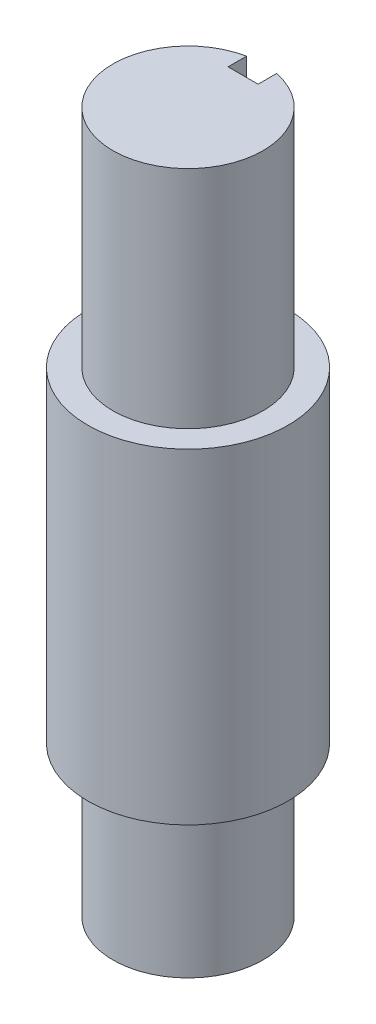
ISO-10303-21;
HEADER;
FILE_DESCRIPTION(('STEP AP214'),'2;1');
FILE_NAME('part.step','',(''),(''),'','','');
FILE_SCHEMA(('AUTOMOTIVE_DESIGN { 1 0 10303 214 1 1 1 1 }'));
ENDSEC;
DATA;
#1=APPLICATION_CONTEXT('core data for automotive mechanical design processes');
#2=APPLICATION_PROTOCOL_DEFINITION('international standard','automotive_design',2000,#1);
#3=PRODUCT_CONTEXT('',#1,'mechanical');
#4=PRODUCT('Part','Part','',(#3));
#5=PRODUCT_RELATED_PRODUCT_CATEGORY('part','',(#4));
#6=PRODUCT_DEFINITION_FORMATION('','',#4);
#7=PRODUCT_DEFINITION_CONTEXT('part definition',#1,'design');
#8=PRODUCT_DEFINITION('design','',#6,#7);
#9=PRODUCT_DEFINITION_SHAPE('','',#8);
#10=(LENGTH_UNIT() NAMED_UNIT(*) SI_UNIT(.MILLI.,.METRE.));
#11=(NAMED_UNIT(*) PLANE_ANGLE_UNIT() SI_UNIT($,.RADIAN.));
#12=(NAMED_UNIT(*) SI_UNIT($,.STERADIAN.) SOLID_ANGLE_UNIT());
#13=UNCERTAINTY_MEASURE_WITH_UNIT(LENGTH_MEASURE(1.E-05),#10,'distance_accuracy_value','');
#14=(GEOMETRIC_REPRESENTATION_CONTEXT(3) GLOBAL_UNCERTAINTY_ASSIGNED_CONTEXT((#13)) GLOBAL_UNIT_ASSIGNED_CONTEXT((#10,
#11,#12)) REPRESENTATION_CONTEXT('',''));
#15=CARTESIAN_POINT('',(0.,0.,0.));
#16=DIRECTION('',(0.,0.,1.));
#17=DIRECTION('',(1.,0.,0.));
#18=AXIS2_PLACEMENT_3D('',#15,#16,#17);
#19=CARTESIAN_POINT('',(0.,40.,0.));
#20=DIRECTION('',(0.,-1.,0.));
#21=DIRECTION('',(0.,0.,-1.));
#22=AXIS2_PLACEMENT_3D('',#19,#20,#21);
#23=CYLINDRICAL_SURFACE('',#22,20.);
#24=CARTESIAN_POINT('',(0.,-40.,0.));
#25=DIRECTION('',(0.,1.,0.));
#26=DIRECTION('',(0.,0.,1.));
#27=AXIS2_PLACEMENT_3D('',#24,#25,#26);
#28=CIRCLE('',#27,20.);
#29=CARTESIAN_POINT('',(0.,-40.,20.));
#30=VERTEX_POINT('',#29);
#31=EDGE_CURVE('E119',#30,#30,#28,.T.);
#32=ORIENTED_EDGE('',*,*,#31,.T.);
#33=EDGE_LOOP('',(#32));
#34=FACE_BOUND('',#33,.T.);
#35=CARTESIAN_POINT('',(0.,25.,0.));
#36=DIRECTION('',(0.,1.,0.));
#37=DIRECTION('',(0.,0.,1.));
#38=AXIS2_PLACEMENT_3D('',#35,#36,#37);
#39=CIRCLE('',#38,20.);
#40=CARTESIAN_POINT('',(0.,25.,20.));
#41=VERTEX_POINT('',#40);
#42=EDGE_CURVE('E109',#41,#41,#39,.T.);
#43=ORIENTED_EDGE('',*,*,#42,.F.);
#44=EDGE_LOOP('',(#43));
#45=FACE_BOUND('',#44,.T.);
#46=ADVANCED_FACE('F42',(#34,#45),#23,.T.);
#47=CARTESIAN_POINT('',(0.,-40.,0.));
#48=DIRECTION('',(0.,1.,0.));
#49=DIRECTION('',(0.,0.,1.));
#50=AXIS2_PLACEMENT_3D('',#47,#48,#49);
#51=PLANE('',#50);
#52=CARTESIAN_POINT('',(0.,-40.,0.));
#53=DIRECTION('',(0.,-1.,0.));
#54=DIRECTION('',(0.,0.,-1.));
#55=AXIS2_PLACEMENT_3D('',#52,#53,#54);
#56=CIRCLE('',#55,15.);
#57=CARTESIAN_POINT('',(0.,-40.,-15.));
#58=VERTEX_POINT('',#57);
#59=EDGE_CURVE('E116',#58,#58,#56,.T.);
#60=ORIENTED_EDGE('',*,*,#59,.F.);
#61=EDGE_LOOP('',(#60));
#62=FACE_BOUND('',#61,.T.);
#63=ORIENTED_EDGE('',*,*,#31,.F.);
#64=EDGE_LOOP('',(#63));
#65=FACE_BOUND('',#64,.T.);
#66=ADVANCED_FACE('F141',(#62,#65),#51,.F.);
#67=CARTESIAN_POINT('',(0.,-70.,0.));
#68=DIRECTION('',(0.,1.,0.));
#69=DIRECTION('',(0.,0.,1.));
#70=AXIS2_PLACEMENT_3D('',#67,#68,#69);
#71=CYLINDRICAL_SURFACE('',#70,15.);
#72=CARTESIAN_POINT('',(0.,-70.,0.));
#73=DIRECTION('',(0.,-1.,0.));
#74=DIRECTION('',(0.,0.,-1.));
#75=AXIS2_PLACEMENT_3D('',#72,#73,#74);
#76=CIRCLE('',#75,15.);
#77=CARTESIAN_POINT('',(0.,-70.,-15.));
#78=VERTEX_POINT('',#77);
#79=EDGE_CURVE('E112',#78,#78,#76,.T.);
#80=ORIENTED_EDGE('',*,*,#79,.F.);
#81=EDGE_LOOP('',(#80));
#82=FACE_BOUND('',#81,.T.);
#83=ORIENTED_EDGE('',*,*,#59,.T.);
#84=EDGE_LOOP('',(#83));
#85=FACE_BOUND('',#84,.T.);
#86=ADVANCED_FACE('F146',(#82,#85),#71,.T.);
#87=CARTESIAN_POINT('',(0.,-70.,0.));
#88=DIRECTION('',(0.,-1.,0.));
#89=DIRECTION('',(0.,0.,-1.));
#90=AXIS2_PLACEMENT_3D('',#87,#88,#89);
#91=PLANE('',#90);
#92=ORIENTED_EDGE('',*,*,#79,.T.);
#93=EDGE_LOOP('',(#92));
#94=FACE_BOUND('',#93,.T.);
#95=ADVANCED_FACE('F152',(#94),#91,.T.);
#96=CARTESIAN_POINT('',(0.,25.,0.));
#97=DIRECTION('',(0.,1.,0.));
#98=DIRECTION('',(0.,0.,1.));
#99=AXIS2_PLACEMENT_3D('',#96,#97,#98);
#100=PLANE('',#99);
#101=CARTESIAN_POINT('',(0.,25.,0.));
#102=DIRECTION('',(0.,1.,0.));
#103=DIRECTION('',(0.,0.,1.));
#104=AXIS2_PLACEMENT_3D('',#101,#102,#103);
#105=CIRCLE('',#104,15.);
#106=CARTESIAN_POINT('',(-3.,25.,-14.6969384566991));
#107=VERTEX_POINT('',#106);
#108=CARTESIAN_POINT('',(3.,25.,-14.6969384566991));
#109=VERTEX_POINT('',#108);
#110=EDGE_CURVE('E106',#107,#109,#105,.T.);
#111=ORIENTED_EDGE('',*,*,#110,.F.);
#112=DIRECTION('',(0.,0.,-1.));
#113=VECTOR('',#112,1.);
#114=CARTESIAN_POINT('',(-3.,25.,-19.));
#115=LINE('',#114,#113);
#116=CARTESIAN_POINT('',(-3.,25.,-11.));
#117=VERTEX_POINT('',#116);
#118=EDGE_CURVE('E104',#117,#107,#115,.T.);
#119=ORIENTED_EDGE('',*,*,#118,.F.);
#120=DIRECTION('',(-1.,0.,0.));
#121=VECTOR('',#120,1.);
#122=CARTESIAN_POINT('',(-3.,25.,-11.));
#123=LINE('',#122,#121);
#124=CARTESIAN_POINT('',(3.,25.,-11.));
#125=VERTEX_POINT('',#124);
#126=EDGE_CURVE('E96',#125,#117,#123,.T.);
#127=ORIENTED_EDGE('',*,*,#126,.F.);
#128=DIRECTION('',(0.,0.,1.));
#129=VECTOR('',#128,1.);
#130=CARTESIAN_POINT('',(3.,25.,-19.));
#131=LINE('',#130,#129);
#132=EDGE_CURVE('E56',#109,#125,#131,.T.);
#133=ORIENTED_EDGE('',*,*,#132,.F.);
#134=EDGE_LOOP('',(#111,#119,#127,#133));
#135=FACE_BOUND('',#134,.T.);
#136=ORIENTED_EDGE('',*,*,#42,.T.);
#137=EDGE_LOOP('',(#136));
#138=FACE_BOUND('',#137,.T.);
#139=ADVANCED_FACE('F124',(#135,#138),#100,.T.);
#140=CARTESIAN_POINT('',(0.,70.,0.));
#141=DIRECTION('',(0.,1.,0.));
#142=DIRECTION('',(0.,0.,1.));
#143=AXIS2_PLACEMENT_3D('',#140,#141,#142);
#144=PLANE('',#143);
#145=DIRECTION('',(0.,0.,-1.));
#146=VECTOR('',#145,1.);
#147=CARTESIAN_POINT('',(3.,70.,-19.));
#148=LINE('',#147,#146);
#149=CARTESIAN_POINT('',(3.,70.,-11.));
#150=VERTEX_POINT('',#149);
#151=CARTESIAN_POINT('',(3.,70.,-14.6969384566991));
#152=VERTEX_POINT('',#151);
#153=EDGE_CURVE('E89',#150,#152,#148,.T.);
#154=ORIENTED_EDGE('',*,*,#153,.F.);
#155=DIRECTION('',(1.,0.,0.));
#156=VECTOR('',#155,1.);
#157=CARTESIAN_POINT('',(-3.,70.,-11.));
#158=LINE('',#157,#156);
#159=CARTESIAN_POINT('',(-3.,70.,-11.));
#160=VERTEX_POINT('',#159);
#161=EDGE_CURVE('E88',#160,#150,#158,.T.);
#162=ORIENTED_EDGE('',*,*,#161,.F.);
#163=DIRECTION('',(0.,0.,1.));
#164=VECTOR('',#163,1.);
#165=CARTESIAN_POINT('',(-3.,70.,-19.));
#166=LINE('',#165,#164);
#167=CARTESIAN_POINT('',(-3.,70.,-14.6969384566991));
#168=VERTEX_POINT('',#167);
#169=EDGE_CURVE('E80',#168,#160,#166,.T.);
#170=ORIENTED_EDGE('',*,*,#169,.F.);
#171=CARTESIAN_POINT('',(0.,70.,0.));
#172=DIRECTION('',(0.,1.,0.));
#173=DIRECTION('',(0.,0.,1.));
#174=AXIS2_PLACEMENT_3D('',#171,#172,#173);
#175=CIRCLE('',#174,15.);
#176=EDGE_CURVE('E115',#168,#152,#175,.T.);
#177=ORIENTED_EDGE('',*,*,#176,.T.);
#178=EDGE_LOOP('',(#154,#162,#170,#177));
#179=FACE_BOUND('',#178,.T.);
#180=ADVANCED_FACE('F100',(#179),#144,.T.);
#181=CARTESIAN_POINT('',(0.,70.,0.));
#182=DIRECTION('',(0.,-1.,0.));
#183=DIRECTION('',(0.,0.,-1.));
#184=AXIS2_PLACEMENT_3D('',#181,#182,#183);
#185=CYLINDRICAL_SURFACE('',#184,15.);
#186=ORIENTED_EDGE('',*,*,#110,.T.);
#187=DIRECTION('',(0.,-1.,0.));
#188=VECTOR('',#187,1.);
#189=CARTESIAN_POINT('',(3.,70.,-14.6969384566991));
#190=LINE('',#189,#188);
#191=EDGE_CURVE('E11',#109,#152,#190,.F.);
#192=ORIENTED_EDGE('',*,*,#191,.T.);
#193=ORIENTED_EDGE('',*,*,#176,.F.);
#194=DIRECTION('',(0.,-1.,0.));
#195=VECTOR('',#194,1.);
#196=CARTESIAN_POINT('',(-3.,70.,-14.6969384566991));
#197=LINE('',#196,#195);
#198=EDGE_CURVE('E49',#168,#107,#197,.T.);
#199=ORIENTED_EDGE('',*,*,#198,.T.);
#200=EDGE_LOOP('',(#186,#192,#193,#199));
#201=FACE_BOUND('',#200,.T.);
#202=ADVANCED_FACE('F123',(#201),#185,.T.);
#203=CARTESIAN_POINT('',(3.,15.,-19.));
#204=DIRECTION('',(1.,0.,0.));
#205=DIRECTION('',(0.,0.,-1.));
#206=AXIS2_PLACEMENT_3D('',#203,#204,#205);
#207=PLANE('',#206);
#208=ORIENTED_EDGE('',*,*,#132,.T.);
#209=DIRECTION('',(0.,1.,0.));
#210=VECTOR('',#209,1.);
#211=CARTESIAN_POINT('',(3.,15.,-11.));
#212=LINE('',#211,#210);
#213=EDGE_CURVE('E98',#125,#150,#212,.T.);
#214=ORIENTED_EDGE('',*,*,#213,.T.);
#215=ORIENTED_EDGE('',*,*,#153,.T.);
#216=ORIENTED_EDGE('',*,*,#191,.F.);
#217=EDGE_LOOP('',(#208,#214,#215,#216));
#218=FACE_BOUND('',#217,.T.);
#219=ADVANCED_FACE('F130',(#218),#207,.F.);
#220=CARTESIAN_POINT('',(-3.,15.,-19.));
#221=DIRECTION('',(-1.,0.,0.));
#222=DIRECTION('',(0.,0.,1.));
#223=AXIS2_PLACEMENT_3D('',#220,#221,#222);
#224=PLANE('',#223);
#225=ORIENTED_EDGE('',*,*,#169,.T.);
#226=DIRECTION('',(0.,1.,0.));
#227=VECTOR('',#226,1.);
#228=CARTESIAN_POINT('',(-3.,15.,-11.));
#229=LINE('',#228,#227);
#230=EDGE_CURVE('E83',#117,#160,#229,.T.);
#231=ORIENTED_EDGE('',*,*,#230,.F.);
#232=ORIENTED_EDGE('',*,*,#118,.T.);
#233=ORIENTED_EDGE('',*,*,#198,.F.);
#234=EDGE_LOOP('',(#225,#231,#232,#233));
#235=FACE_BOUND('',#234,.T.);
#236=ADVANCED_FACE('F82',(#235),#224,.F.);
#237=CARTESIAN_POINT('',(-3.,15.,-11.));
#238=DIRECTION('',(0.,0.,1.));
#239=DIRECTION('',(1.,0.,0.));
#240=AXIS2_PLACEMENT_3D('',#237,#238,#239);
#241=PLANE('',#240);
#242=ORIENTED_EDGE('',*,*,#126,.T.);
#243=ORIENTED_EDGE('',*,*,#230,.T.);
#244=ORIENTED_EDGE('',*,*,#161,.T.);
#245=ORIENTED_EDGE('',*,*,#213,.F.);
#246=EDGE_LOOP('',(#242,#243,#244,#245));
#247=FACE_BOUND('',#246,.T.);
#248=ADVANCED_FACE('F93',(#247),#241,.F.);
#249=CLOSED_SHELL('',(#46,#66,#86,#95,#139,#180,#202,#219,#236,#248));
#250=MANIFOLD_SOLID_BREP('B2',#249);
#251=ADVANCED_BREP_SHAPE_REPRESENTATION('',(#18,#250),#14);
#252=SHAPE_DEFINITION_REPRESENTATION(#9,#251);
ENDSEC;
END-ISO-10303-21;
